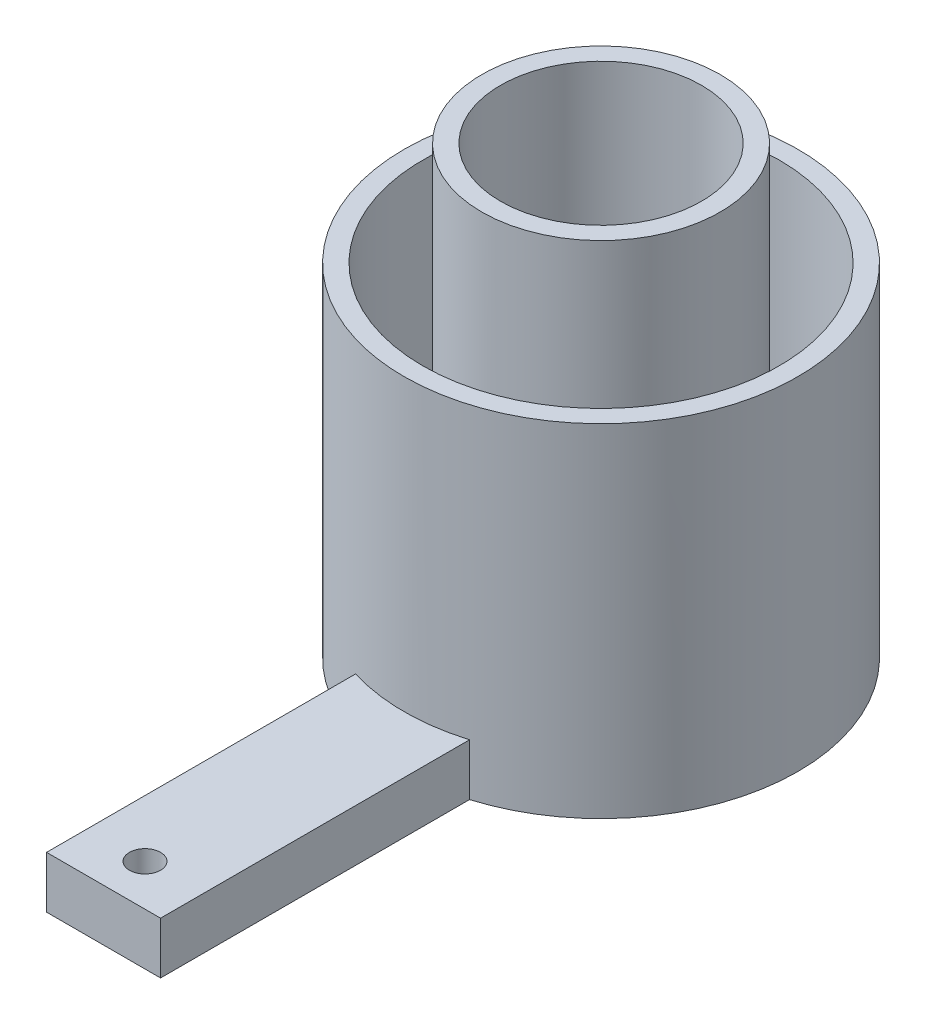
ISO-10303-21;
HEADER;
FILE_DESCRIPTION(('STEP AP214'),'2;1');
FILE_NAME('part.step','',(''),(''),'','','');
FILE_SCHEMA(('AUTOMOTIVE_DESIGN { 1 0 10303 214 1 1 1 1 }'));
ENDSEC;
DATA;
#1=APPLICATION_CONTEXT('core data for automotive mechanical design processes');
#2=APPLICATION_PROTOCOL_DEFINITION('international standard','automotive_design',2000,#1);
#3=PRODUCT_CONTEXT('',#1,'mechanical');
#4=PRODUCT('Part','Part','',(#3));
#5=PRODUCT_RELATED_PRODUCT_CATEGORY('part','',(#4));
#6=PRODUCT_DEFINITION_FORMATION('','',#4);
#7=PRODUCT_DEFINITION_CONTEXT('part definition',#1,'design');
#8=PRODUCT_DEFINITION('design','',#6,#7);
#9=PRODUCT_DEFINITION_SHAPE('','',#8);
#10=(LENGTH_UNIT() NAMED_UNIT(*) SI_UNIT(.MILLI.,.METRE.));
#11=(NAMED_UNIT(*) PLANE_ANGLE_UNIT() SI_UNIT($,.RADIAN.));
#12=(NAMED_UNIT(*) SI_UNIT($,.STERADIAN.) SOLID_ANGLE_UNIT());
#13=UNCERTAINTY_MEASURE_WITH_UNIT(LENGTH_MEASURE(1.E-05),#10,'distance_accuracy_value','');
#14=(GEOMETRIC_REPRESENTATION_CONTEXT(3) GLOBAL_UNCERTAINTY_ASSIGNED_CONTEXT((#13)) GLOBAL_UNIT_ASSIGNED_CONTEXT((#10,
#11,#12)) REPRESENTATION_CONTEXT('',''));
#15=CARTESIAN_POINT('',(0.,0.,0.));
#16=DIRECTION('',(0.,0.,1.));
#17=DIRECTION('',(1.,0.,0.));
#18=AXIS2_PLACEMENT_3D('',#15,#16,#17);
#19=CARTESIAN_POINT('',(0.,33.,0.));
#20=DIRECTION('',(0.,-1.,0.));
#21=DIRECTION('',(0.,0.,-1.));
#22=AXIS2_PLACEMENT_3D('',#19,#20,#21);
#23=CYLINDRICAL_SURFACE('',#22,17.2);
#24=CARTESIAN_POINT('',(0.,10.,0.));
#25=DIRECTION('',(0.,-1.,0.));
#26=DIRECTION('',(0.,0.,-1.));
#27=AXIS2_PLACEMENT_3D('',#24,#25,#26);
#28=CIRCLE('',#27,17.2);
#29=CARTESIAN_POINT('',(0.,10.,-17.2));
#30=VERTEX_POINT('',#29);
#31=EDGE_CURVE('E265',#30,#30,#28,.T.);
#32=ORIENTED_EDGE('',*,*,#31,.F.);
#33=EDGE_LOOP('',(#32));
#34=FACE_BOUND('',#33,.T.);
#35=CARTESIAN_POINT('',(0.,5.,0.));
#36=DIRECTION('',(0.,-1.,0.));
#37=DIRECTION('',(0.,0.,-1.));
#38=AXIS2_PLACEMENT_3D('',#35,#36,#37);
#39=CIRCLE('',#38,17.2);
#40=CARTESIAN_POINT('',(5.5,5.,16.2969322266493));
#41=VERTEX_POINT('',#40);
#42=CARTESIAN_POINT('',(-5.5,5.,16.2969322266493));
#43=VERTEX_POINT('',#42);
#44=EDGE_CURVE('E178',#41,#43,#39,.T.);
#45=ORIENTED_EDGE('',*,*,#44,.T.);
#46=DIRECTION('',(0.,-1.,0.));
#47=VECTOR('',#46,1.);
#48=CARTESIAN_POINT('',(-5.5,33.,16.2969322266493));
#49=LINE('',#48,#47);
#50=CARTESIAN_POINT('',(-5.5,0.,16.2969322266493));
#51=VERTEX_POINT('',#50);
#52=EDGE_CURVE('E186',#43,#51,#49,.T.);
#53=ORIENTED_EDGE('',*,*,#52,.T.);
#54=CARTESIAN_POINT('',(0.,0.,0.));
#55=DIRECTION('',(0.,1.,0.));
#56=DIRECTION('',(0.,0.,1.));
#57=AXIS2_PLACEMENT_3D('',#54,#55,#56);
#58=CIRCLE('',#57,17.2);
#59=CARTESIAN_POINT('',(-13.4339705934385,0.,-10.7409698861243));
#60=VERTEX_POINT('',#59);
#61=EDGE_CURVE('E266',#60,#51,#58,.T.);
#62=ORIENTED_EDGE('',*,*,#61,.F.);
#63=DIRECTION('',(0.,-1.,0.));
#64=VECTOR('',#63,1.);
#65=CARTESIAN_POINT('',(-13.4339705934385,33.,-10.7409698861243));
#66=LINE('',#65,#64);
#67=CARTESIAN_POINT('',(-13.4339705934385,2.4,-10.7409698861243));
#68=VERTEX_POINT('',#67);
#69=EDGE_CURVE('E225',#68,#60,#66,.T.);
#70=ORIENTED_EDGE('',*,*,#69,.F.);
#71=CARTESIAN_POINT('',(0.,2.4,0.));
#72=DIRECTION('',(0.,-1.,0.));
#73=DIRECTION('',(0.,0.,-1.));
#74=AXIS2_PLACEMENT_3D('',#71,#72,#73);
#75=CIRCLE('',#74,17.2);
#76=CARTESIAN_POINT('',(-6.92620660055423,2.4,-15.7438134556542));
#77=VERTEX_POINT('',#76);
#78=EDGE_CURVE('E231',#68,#77,#75,.T.);
#79=ORIENTED_EDGE('',*,*,#78,.T.);
#80=DIRECTION('',(0.,-1.,0.));
#81=VECTOR('',#80,1.);
#82=CARTESIAN_POINT('',(-6.92620660055423,33.,-15.7438134556542));
#83=LINE('',#82,#81);
#84=CARTESIAN_POINT('',(-6.92620660055423,0.,-15.7438134556542));
#85=VERTEX_POINT('',#84);
#86=EDGE_CURVE('E217',#85,#77,#83,.F.);
#87=ORIENTED_EDGE('',*,*,#86,.F.);
#88=CARTESIAN_POINT('',(5.5,0.,16.2969322266493));
#89=VERTEX_POINT('',#88);
#90=EDGE_CURVE('E257',#89,#85,#58,.T.);
#91=ORIENTED_EDGE('',*,*,#90,.F.);
#92=DIRECTION('',(0.,-1.,0.));
#93=VECTOR('',#92,1.);
#94=CARTESIAN_POINT('',(5.5,33.,16.2969322266493));
#95=LINE('',#94,#93);
#96=EDGE_CURVE('E182',#41,#89,#95,.T.);
#97=ORIENTED_EDGE('',*,*,#96,.F.);
#98=EDGE_LOOP('',(#45,#53,#62,#70,#79,#87,#91,#97));
#99=FACE_BOUND('',#98,.T.);
#100=ADVANCED_FACE('F36',(#34,#99),#23,.F.);
#101=CARTESIAN_POINT('',(0.,33.,0.));
#102=DIRECTION('',(0.,-1.,0.));
#103=DIRECTION('',(0.,0.,-1.));
#104=AXIS2_PLACEMENT_3D('',#101,#102,#103);
#105=CYLINDRICAL_SURFACE('',#104,19.);
#106=CARTESIAN_POINT('',(0.,33.,0.));
#107=DIRECTION('',(0.,1.,0.));
#108=DIRECTION('',(0.,0.,1.));
#109=AXIS2_PLACEMENT_3D('',#106,#107,#108);
#110=CIRCLE('',#109,19.);
#111=CARTESIAN_POINT('',(0.,33.,19.));
#112=VERTEX_POINT('',#111);
#113=EDGE_CURVE('E261',#112,#112,#110,.T.);
#114=ORIENTED_EDGE('',*,*,#113,.F.);
#115=EDGE_LOOP('',(#114));
#116=FACE_BOUND('',#115,.T.);
#117=DIRECTION('',(0.,-1.,0.));
#118=VECTOR('',#117,1.);
#119=CARTESIAN_POINT('',(-5.5,33.,18.1865334794732));
#120=LINE('',#119,#118);
#121=CARTESIAN_POINT('',(-5.5,5.,18.1865334794732));
#122=VERTEX_POINT('',#121);
#123=CARTESIAN_POINT('',(-5.5,0.,18.1865334794732));
#124=VERTEX_POINT('',#123);
#125=EDGE_CURVE('E51',#122,#124,#120,.T.);
#126=ORIENTED_EDGE('',*,*,#125,.F.);
#127=CARTESIAN_POINT('',(0.,5.,0.));
#128=DIRECTION('',(0.,-1.,0.));
#129=DIRECTION('',(0.,0.,-1.));
#130=AXIS2_PLACEMENT_3D('',#127,#128,#129);
#131=CIRCLE('',#130,19.);
#132=CARTESIAN_POINT('',(5.5,5.,18.1865334794732));
#133=VERTEX_POINT('',#132);
#134=EDGE_CURVE('E55',#133,#122,#131,.T.);
#135=ORIENTED_EDGE('',*,*,#134,.F.);
#136=DIRECTION('',(0.,-1.,0.));
#137=VECTOR('',#136,1.);
#138=CARTESIAN_POINT('',(5.5,33.,18.1865334794732));
#139=LINE('',#138,#137);
#140=CARTESIAN_POINT('',(5.5,0.,18.1865334794732));
#141=VERTEX_POINT('',#140);
#142=EDGE_CURVE('E155',#133,#141,#139,.T.);
#143=ORIENTED_EDGE('',*,*,#142,.T.);
#144=CARTESIAN_POINT('',(0.,0.,0.));
#145=DIRECTION('',(0.,1.,0.));
#146=DIRECTION('',(0.,0.,1.));
#147=AXIS2_PLACEMENT_3D('',#144,#145,#146);
#148=CIRCLE('',#147,19.);
#149=EDGE_CURVE('E262',#141,#124,#148,.T.);
#150=ORIENTED_EDGE('',*,*,#149,.T.);
#151=EDGE_LOOP('',(#126,#135,#143,#150));
#152=FACE_BOUND('',#151,.T.);
#153=ADVANCED_FACE('F319',(#116,#152),#105,.T.);
#154=CARTESIAN_POINT('',(0.,43.,0.));
#155=DIRECTION('',(0.,-1.,0.));
#156=DIRECTION('',(0.,0.,-1.));
#157=AXIS2_PLACEMENT_3D('',#154,#155,#156);
#158=CYLINDRICAL_SURFACE('',#157,11.5);
#159=CARTESIAN_POINT('',(0.,10.,0.));
#160=DIRECTION('',(0.,-1.,0.));
#161=DIRECTION('',(0.,0.,-1.));
#162=AXIS2_PLACEMENT_3D('',#159,#160,#161);
#163=CIRCLE('',#162,11.5);
#164=CARTESIAN_POINT('',(0.,10.,-11.5));
#165=VERTEX_POINT('',#164);
#166=EDGE_CURVE('E242',#165,#165,#163,.F.);
#167=ORIENTED_EDGE('',*,*,#166,.F.);
#168=EDGE_LOOP('',(#167));
#169=FACE_BOUND('',#168,.T.);
#170=DIRECTION('',(0.,-1.,0.));
#171=VECTOR('',#170,1.);
#172=CARTESIAN_POINT('',(-5.5,43.,10.0995049383621));
#173=LINE('',#172,#171);
#174=CARTESIAN_POINT('',(-5.5,5.,10.0995049383621));
#175=VERTEX_POINT('',#174);
#176=CARTESIAN_POINT('',(-5.5,0.,10.0995049383621));
#177=VERTEX_POINT('',#176);
#178=EDGE_CURVE('E11',#175,#177,#173,.T.);
#179=ORIENTED_EDGE('',*,*,#178,.F.);
#180=CARTESIAN_POINT('',(0.,5.,0.));
#181=DIRECTION('',(0.,-1.,0.));
#182=DIRECTION('',(0.,0.,-1.));
#183=AXIS2_PLACEMENT_3D('',#180,#181,#182);
#184=CIRCLE('',#183,11.5);
#185=CARTESIAN_POINT('',(5.5,5.,10.0995049383621));
#186=VERTEX_POINT('',#185);
#187=EDGE_CURVE('E278',#186,#175,#184,.T.);
#188=ORIENTED_EDGE('',*,*,#187,.F.);
#189=DIRECTION('',(0.,-1.,0.));
#190=VECTOR('',#189,1.);
#191=CARTESIAN_POINT('',(5.5,43.,10.0995049383621));
#192=LINE('',#191,#190);
#193=CARTESIAN_POINT('',(5.5,0.,10.0995049383621));
#194=VERTEX_POINT('',#193);
#195=EDGE_CURVE('E44',#186,#194,#192,.T.);
#196=ORIENTED_EDGE('',*,*,#195,.T.);
#197=CARTESIAN_POINT('',(0.,0.,0.));
#198=DIRECTION('',(0.,1.,0.));
#199=DIRECTION('',(0.,0.,1.));
#200=AXIS2_PLACEMENT_3D('',#197,#198,#199);
#201=CIRCLE('',#200,11.5);
#202=CARTESIAN_POINT('',(-5.01101741859494,0.,-10.3508310985417));
#203=VERTEX_POINT('',#202);
#204=EDGE_CURVE('E244',#194,#203,#201,.T.);
#205=ORIENTED_EDGE('',*,*,#204,.T.);
#206=DIRECTION('',(0.,-1.,0.));
#207=VECTOR('',#206,1.);
#208=CARTESIAN_POINT('',(-5.01101741859494,43.,-10.3508310985417));
#209=LINE('',#208,#207);
#210=CARTESIAN_POINT('',(-5.01101741859494,2.4,-10.3508310985417));
#211=VERTEX_POINT('',#210);
#212=EDGE_CURVE('E211',#203,#211,#209,.F.);
#213=ORIENTED_EDGE('',*,*,#212,.T.);
#214=CARTESIAN_POINT('',(0.,2.4,0.));
#215=DIRECTION('',(0.,-1.,0.));
#216=DIRECTION('',(0.,0.,-1.));
#217=AXIS2_PLACEMENT_3D('',#214,#215,#216);
#218=CIRCLE('',#217,11.5);
#219=CARTESIAN_POINT('',(-8.71463450240619,2.4,-7.50367546536173));
#220=VERTEX_POINT('',#219);
#221=EDGE_CURVE('E252',#220,#211,#218,.T.);
#222=ORIENTED_EDGE('',*,*,#221,.F.);
#223=DIRECTION('',(0.,-1.,0.));
#224=VECTOR('',#223,1.);
#225=CARTESIAN_POINT('',(-8.71463450240619,43.,-7.50367546536173));
#226=LINE('',#225,#224);
#227=CARTESIAN_POINT('',(-8.71463450240619,0.,-7.50367546536173));
#228=VERTEX_POINT('',#227);
#229=EDGE_CURVE('E219',#220,#228,#226,.T.);
#230=ORIENTED_EDGE('',*,*,#229,.T.);
#231=EDGE_CURVE('E239',#228,#177,#201,.T.);
#232=ORIENTED_EDGE('',*,*,#231,.T.);
#233=EDGE_LOOP('',(#179,#188,#196,#205,#213,#222,#230,#232));
#234=FACE_BOUND('',#233,.T.);
#235=ADVANCED_FACE('F285',(#169,#234),#158,.T.);
#236=CARTESIAN_POINT('',(0.,33.,0.));
#237=DIRECTION('',(0.,1.,0.));
#238=DIRECTION('',(0.,0.,1.));
#239=AXIS2_PLACEMENT_3D('',#236,#237,#238);
#240=CIRCLE('',#239,17.2);
#241=CARTESIAN_POINT('',(0.,33.,17.2));
#242=VERTEX_POINT('',#241);
#243=EDGE_CURVE('E258',#242,#242,#240,.T.);
#244=ORIENTED_EDGE('',*,*,#243,.T.);
#245=EDGE_LOOP('',(#244));
#246=FACE_BOUND('',#245,.T.);
#247=CARTESIAN_POINT('',(0.,13.,0.));
#248=DIRECTION('',(0.,-1.,0.));
#249=DIRECTION('',(0.,0.,-1.));
#250=AXIS2_PLACEMENT_3D('',#247,#248,#249);
#251=CIRCLE('',#250,17.2);
#252=CARTESIAN_POINT('',(0.,13.,-17.2));
#253=VERTEX_POINT('',#252);
#254=EDGE_CURVE('E254',#253,#253,#251,.T.);
#255=ORIENTED_EDGE('',*,*,#254,.T.);
#256=EDGE_LOOP('',(#255));
#257=FACE_BOUND('',#256,.T.);
#258=ADVANCED_FACE('F321',(#246,#257),#23,.F.);
#259=CARTESIAN_POINT('',(0.,33.,0.));
#260=DIRECTION('',(0.,1.,0.));
#261=DIRECTION('',(0.,0.,1.));
#262=AXIS2_PLACEMENT_3D('',#259,#260,#261);
#263=PLANE('',#262);
#264=ORIENTED_EDGE('',*,*,#243,.F.);
#265=EDGE_LOOP('',(#264));
#266=FACE_BOUND('',#265,.T.);
#267=ORIENTED_EDGE('',*,*,#113,.T.);
#268=EDGE_LOOP('',(#267));
#269=FACE_BOUND('',#268,.T.);
#270=ADVANCED_FACE('F329',(#266,#269),#263,.T.);
#271=CARTESIAN_POINT('',(0.,0.,0.));
#272=DIRECTION('',(0.,1.,0.));
#273=DIRECTION('',(0.,0.,1.));
#274=AXIS2_PLACEMENT_3D('',#271,#272,#273);
#275=PLANE('',#274);
#276=CARTESIAN_POINT('',(0.,0.,44.));
#277=DIRECTION('',(0.,-1.,0.));
#278=DIRECTION('',(0.,0.,-1.));
#279=AXIS2_PLACEMENT_3D('',#276,#277,#278);
#280=CIRCLE('',#279,1.5);
#281=CARTESIAN_POINT('',(0.,0.,42.5));
#282=VERTEX_POINT('',#281);
#283=EDGE_CURVE('E302',#282,#282,#280,.T.);
#284=ORIENTED_EDGE('',*,*,#283,.F.);
#285=EDGE_LOOP('',(#284));
#286=FACE_BOUND('',#285,.T.);
#287=ORIENTED_EDGE('',*,*,#61,.T.);
#288=DIRECTION('',(0.,0.,1.));
#289=VECTOR('',#288,1.);
#290=CARTESIAN_POINT('',(-5.5,0.,0.));
#291=LINE('',#290,#289);
#292=EDGE_CURVE('E297',#177,#51,#291,.T.);
#293=ORIENTED_EDGE('',*,*,#292,.F.);
#294=ORIENTED_EDGE('',*,*,#231,.F.);
#295=DIRECTION('',(-0.824632815792926,0.,-0.565668382639006));
#296=VECTOR('',#295,1.);
#297=CARTESIAN_POINT('',(-14.9219179053918,0.,-11.7616480998518));
#298=LINE('',#297,#296);
#299=EDGE_CURVE('E207',#228,#60,#298,.T.);
#300=ORIENTED_EDGE('',*,*,#299,.T.);
#301=EDGE_LOOP('',(#287,#293,#294,#300));
#302=FACE_BOUND('',#301,.T.);
#303=DIRECTION('',(0.,0.,1.));
#304=VECTOR('',#303,1.);
#305=CARTESIAN_POINT('',(5.5,0.,0.));
#306=LINE('',#305,#304);
#307=EDGE_CURVE('E290',#194,#89,#306,.T.);
#308=ORIENTED_EDGE('',*,*,#307,.T.);
#309=ORIENTED_EDGE('',*,*,#90,.T.);
#310=DIRECTION('',(0.334650429092405,0.,0.942342342415042));
#311=VECTOR('',#310,1.);
#312=CARTESIAN_POINT('',(-3.56545480144874,0.,-6.28027046473769));
#313=LINE('',#312,#311);
#314=EDGE_CURVE('E203',#85,#203,#313,.T.);
#315=ORIENTED_EDGE('',*,*,#314,.T.);
#316=ORIENTED_EDGE('',*,*,#204,.F.);
#317=EDGE_LOOP('',(#308,#309,#315,#316));
#318=FACE_BOUND('',#317,.T.);
#319=CARTESIAN_POINT('',(0.,0.,0.));
#320=DIRECTION('',(0.,1.,0.));
#321=DIRECTION('',(0.,0.,1.));
#322=AXIS2_PLACEMENT_3D('',#319,#320,#321);
#323=CIRCLE('',#322,9.7);
#324=CARTESIAN_POINT('',(-7.21964860347408,0.,-6.47816903471611));
#325=VERTEX_POINT('',#324);
#326=CARTESIAN_POINT('',(-4.40432597607253,0.,-8.64244830453112));
#327=VERTEX_POINT('',#326);
#328=EDGE_CURVE('E234',#325,#327,#323,.T.);
#329=ORIENTED_EDGE('',*,*,#328,.T.);
#330=CARTESIAN_POINT('',(-3.56545480144874,0.,-6.28027046473769));
#331=VERTEX_POINT('',#330);
#332=EDGE_CURVE('E189',#327,#331,#313,.T.);
#333=ORIENTED_EDGE('',*,*,#332,.T.);
#334=DIRECTION('',(-0.792808155570245,0.,0.609471269594642));
#335=VECTOR('',#334,1.);
#336=CARTESIAN_POINT('',(-5.1525342695895,0.,-5.06020312360444));
#337=LINE('',#336,#335);
#338=CARTESIAN_POINT('',(-5.1525342695895,0.,-5.06020312360444));
#339=VERTEX_POINT('',#338);
#340=EDGE_CURVE('E204',#331,#339,#337,.T.);
#341=ORIENTED_EDGE('',*,*,#340,.T.);
#342=EDGE_CURVE('E193',#339,#325,#298,.T.);
#343=ORIENTED_EDGE('',*,*,#342,.T.);
#344=EDGE_LOOP('',(#329,#333,#341,#343));
#345=FACE_BOUND('',#344,.T.);
#346=ORIENTED_EDGE('',*,*,#149,.F.);
#347=CARTESIAN_POINT('',(5.5,0.,48.));
#348=VERTEX_POINT('',#347);
#349=EDGE_CURVE('E295',#141,#348,#306,.T.);
#350=ORIENTED_EDGE('',*,*,#349,.T.);
#351=DIRECTION('',(1.,0.,0.));
#352=VECTOR('',#351,1.);
#353=CARTESIAN_POINT('',(0.,0.,48.));
#354=LINE('',#353,#352);
#355=CARTESIAN_POINT('',(-5.5,0.,48.));
#356=VERTEX_POINT('',#355);
#357=EDGE_CURVE('E171',#356,#348,#354,.T.);
#358=ORIENTED_EDGE('',*,*,#357,.F.);
#359=EDGE_CURVE('E299',#124,#356,#291,.T.);
#360=ORIENTED_EDGE('',*,*,#359,.F.);
#361=EDGE_LOOP('',(#346,#350,#358,#360));
#362=FACE_BOUND('',#361,.T.);
#363=ADVANCED_FACE('F335',(#286,#302,#318,#345,#362),#275,.F.);
#364=CARTESIAN_POINT('',(0.,10.,0.));
#365=DIRECTION('',(0.,-1.,0.));
#366=DIRECTION('',(0.,0.,-1.));
#367=AXIS2_PLACEMENT_3D('',#364,#365,#366);
#368=PLANE('',#367);
#369=ORIENTED_EDGE('',*,*,#166,.T.);
#370=EDGE_LOOP('',(#369));
#371=FACE_BOUND('',#370,.T.);
#372=ORIENTED_EDGE('',*,*,#31,.T.);
#373=EDGE_LOOP('',(#372));
#374=FACE_BOUND('',#373,.T.);
#375=ADVANCED_FACE('F348',(#371,#374),#368,.T.);
#376=CARTESIAN_POINT('',(0.,13.,0.));
#377=DIRECTION('',(0.,-1.,0.));
#378=DIRECTION('',(0.,0.,-1.));
#379=AXIS2_PLACEMENT_3D('',#376,#377,#378);
#380=PLANE('',#379);
#381=CARTESIAN_POINT('',(0.,13.,0.));
#382=DIRECTION('',(0.,-1.,0.));
#383=DIRECTION('',(0.,0.,-1.));
#384=AXIS2_PLACEMENT_3D('',#381,#382,#383);
#385=CIRCLE('',#384,11.5);
#386=CARTESIAN_POINT('',(0.,13.,-11.5));
#387=VERTEX_POINT('',#386);
#388=EDGE_CURVE('E253',#387,#387,#385,.F.);
#389=ORIENTED_EDGE('',*,*,#388,.F.);
#390=EDGE_LOOP('',(#389));
#391=FACE_BOUND('',#390,.T.);
#392=ORIENTED_EDGE('',*,*,#254,.F.);
#393=EDGE_LOOP('',(#392));
#394=FACE_BOUND('',#393,.T.);
#395=ADVANCED_FACE('F345',(#391,#394),#380,.F.);
#396=CARTESIAN_POINT('',(0.,43.,0.));
#397=DIRECTION('',(0.,-1.,0.));
#398=DIRECTION('',(0.,0.,-1.));
#399=AXIS2_PLACEMENT_3D('',#396,#397,#398);
#400=CYLINDRICAL_SURFACE('',#399,9.7);
#401=CARTESIAN_POINT('',(0.,43.,0.));
#402=DIRECTION('',(0.,1.,0.));
#403=DIRECTION('',(0.,0.,1.));
#404=AXIS2_PLACEMENT_3D('',#401,#402,#403);
#405=CIRCLE('',#404,9.7);
#406=CARTESIAN_POINT('',(0.,43.,9.7));
#407=VERTEX_POINT('',#406);
#408=EDGE_CURVE('E235',#407,#407,#405,.T.);
#409=ORIENTED_EDGE('',*,*,#408,.T.);
#410=EDGE_LOOP('',(#409));
#411=FACE_BOUND('',#410,.T.);
#412=CARTESIAN_POINT('',(0.,13.,0.));
#413=DIRECTION('',(0.,-1.,0.));
#414=DIRECTION('',(0.,0.,-1.));
#415=AXIS2_PLACEMENT_3D('',#412,#413,#414);
#416=CIRCLE('',#415,9.7);
#417=CARTESIAN_POINT('',(0.,13.,-9.7));
#418=VERTEX_POINT('',#417);
#419=EDGE_CURVE('E248',#418,#418,#416,.F.);
#420=ORIENTED_EDGE('',*,*,#419,.F.);
#421=EDGE_LOOP('',(#420));
#422=FACE_BOUND('',#421,.T.);
#423=ADVANCED_FACE('F347',(#411,#422),#400,.F.);
#424=CARTESIAN_POINT('',(0.,43.,0.));
#425=DIRECTION('',(0.,1.,0.));
#426=DIRECTION('',(0.,0.,1.));
#427=AXIS2_PLACEMENT_3D('',#424,#425,#426);
#428=PLANE('',#427);
#429=ORIENTED_EDGE('',*,*,#408,.F.);
#430=EDGE_LOOP('',(#429));
#431=FACE_BOUND('',#430,.T.);
#432=CARTESIAN_POINT('',(0.,43.,0.));
#433=DIRECTION('',(0.,1.,0.));
#434=DIRECTION('',(0.,0.,1.));
#435=AXIS2_PLACEMENT_3D('',#432,#433,#434);
#436=CIRCLE('',#435,11.5);
#437=CARTESIAN_POINT('',(0.,43.,11.5));
#438=VERTEX_POINT('',#437);
#439=EDGE_CURVE('E238',#438,#438,#436,.T.);
#440=ORIENTED_EDGE('',*,*,#439,.T.);
#441=EDGE_LOOP('',(#440));
#442=FACE_BOUND('',#441,.T.);
#443=ADVANCED_FACE('F356',(#431,#442),#428,.T.);
#444=ORIENTED_EDGE('',*,*,#439,.F.);
#445=EDGE_LOOP('',(#444));
#446=FACE_BOUND('',#445,.T.);
#447=ORIENTED_EDGE('',*,*,#388,.T.);
#448=EDGE_LOOP('',(#447));
#449=FACE_BOUND('',#448,.T.);
#450=ADVANCED_FACE('F340',(#446,#449),#158,.T.);
#451=ORIENTED_EDGE('',*,*,#419,.T.);
#452=EDGE_LOOP('',(#451));
#453=FACE_BOUND('',#452,.T.);
#454=ADVANCED_FACE('F351',(#453),#380,.F.);
#455=DIRECTION('',(0.,-1.,0.));
#456=VECTOR('',#455,1.);
#457=CARTESIAN_POINT('',(-4.40432597607253,43.,-8.64244830453112));
#458=LINE('',#457,#456);
#459=CARTESIAN_POINT('',(-4.40432597607253,2.4,-8.64244830453112));
#460=VERTEX_POINT('',#459);
#461=EDGE_CURVE('E215',#327,#460,#458,.F.);
#462=ORIENTED_EDGE('',*,*,#461,.F.);
#463=ORIENTED_EDGE('',*,*,#328,.F.);
#464=DIRECTION('',(0.,-1.,0.));
#465=VECTOR('',#464,1.);
#466=CARTESIAN_POINT('',(-7.21964860347408,43.,-6.47816903471611));
#467=LINE('',#466,#465);
#468=CARTESIAN_POINT('',(-7.21964860347408,2.4,-6.47816903471611));
#469=VERTEX_POINT('',#468);
#470=EDGE_CURVE('E222',#469,#325,#467,.T.);
#471=ORIENTED_EDGE('',*,*,#470,.F.);
#472=CARTESIAN_POINT('',(0.,2.4,0.));
#473=DIRECTION('',(0.,-1.,0.));
#474=DIRECTION('',(0.,0.,-1.));
#475=AXIS2_PLACEMENT_3D('',#472,#473,#474);
#476=CIRCLE('',#475,9.7);
#477=EDGE_CURVE('E228',#469,#460,#476,.T.);
#478=ORIENTED_EDGE('',*,*,#477,.T.);
#479=EDGE_LOOP('',(#462,#463,#471,#478));
#480=FACE_BOUND('',#479,.T.);
#481=CARTESIAN_POINT('',(0.,10.,0.));
#482=DIRECTION('',(0.,-1.,0.));
#483=DIRECTION('',(0.,0.,-1.));
#484=AXIS2_PLACEMENT_3D('',#481,#482,#483);
#485=CIRCLE('',#484,9.7);
#486=CARTESIAN_POINT('',(0.,10.,-9.7));
#487=VERTEX_POINT('',#486);
#488=EDGE_CURVE('E249',#487,#487,#485,.F.);
#489=ORIENTED_EDGE('',*,*,#488,.T.);
#490=EDGE_LOOP('',(#489));
#491=FACE_BOUND('',#490,.T.);
#492=ADVANCED_FACE('F359',(#480,#491),#400,.F.);
#493=ORIENTED_EDGE('',*,*,#488,.F.);
#494=EDGE_LOOP('',(#493));
#495=FACE_BOUND('',#494,.T.);
#496=ADVANCED_FACE('F362',(#495),#368,.T.);
#497=CARTESIAN_POINT('',(0.,2.4,0.));
#498=DIRECTION('',(0.,-1.,0.));
#499=DIRECTION('',(0.,0.,-1.));
#500=AXIS2_PLACEMENT_3D('',#497,#498,#499);
#501=PLANE('',#500);
#502=ORIENTED_EDGE('',*,*,#78,.F.);
#503=DIRECTION('',(-0.824632815792926,0.,-0.565668382639006));
#504=VECTOR('',#503,1.);
#505=CARTESIAN_POINT('',(-14.9219179053918,2.4,-11.7616480998518));
#506=LINE('',#505,#504);
#507=EDGE_CURVE('E197',#220,#68,#506,.T.);
#508=ORIENTED_EDGE('',*,*,#507,.F.);
#509=ORIENTED_EDGE('',*,*,#221,.T.);
#510=DIRECTION('',(0.334650429092405,0.,0.942342342415042));
#511=VECTOR('',#510,1.);
#512=CARTESIAN_POINT('',(-3.56545480144874,2.4,-6.28027046473769));
#513=LINE('',#512,#511);
#514=EDGE_CURVE('E192',#77,#211,#513,.T.);
#515=ORIENTED_EDGE('',*,*,#514,.F.);
#516=EDGE_LOOP('',(#502,#508,#509,#515));
#517=FACE_BOUND('',#516,.T.);
#518=ADVANCED_FACE('F397',(#517),#501,.F.);
#519=CARTESIAN_POINT('',(-3.56545480144874,2.4,-6.28027046473769));
#520=DIRECTION('',(0.942342342415042,0.,-0.334650429092405));
#521=DIRECTION('',(-0.334650429092405,0.,-0.942342342415043));
#522=AXIS2_PLACEMENT_3D('',#519,#520,#521);
#523=PLANE('',#522);
#524=ORIENTED_EDGE('',*,*,#314,.F.);
#525=ORIENTED_EDGE('',*,*,#86,.T.);
#526=ORIENTED_EDGE('',*,*,#514,.T.);
#527=ORIENTED_EDGE('',*,*,#212,.F.);
#528=EDGE_LOOP('',(#524,#525,#526,#527));
#529=FACE_BOUND('',#528,.T.);
#530=ADVANCED_FACE('F387',(#529),#523,.T.);
#531=CARTESIAN_POINT('',(-14.9219179053918,2.4,-11.7616480998518));
#532=DIRECTION('',(-0.565668382639006,0.,0.824632815792926));
#533=DIRECTION('',(0.824632815792926,0.,0.565668382639006));
#534=AXIS2_PLACEMENT_3D('',#531,#532,#533);
#535=PLANE('',#534);
#536=ORIENTED_EDGE('',*,*,#507,.T.);
#537=ORIENTED_EDGE('',*,*,#69,.T.);
#538=ORIENTED_EDGE('',*,*,#299,.F.);
#539=ORIENTED_EDGE('',*,*,#229,.F.);
#540=EDGE_LOOP('',(#536,#537,#538,#539));
#541=FACE_BOUND('',#540,.T.);
#542=ADVANCED_FACE('F396',(#541),#535,.T.);
#543=ORIENTED_EDGE('',*,*,#477,.F.);
#544=CARTESIAN_POINT('',(-5.1525342695895,2.4,-5.06020312360444));
#545=VERTEX_POINT('',#544);
#546=EDGE_CURVE('E198',#545,#469,#506,.T.);
#547=ORIENTED_EDGE('',*,*,#546,.F.);
#548=DIRECTION('',(-0.792808155570245,0.,0.609471269594642));
#549=VECTOR('',#548,1.);
#550=CARTESIAN_POINT('',(-5.1525342695895,2.4,-5.06020312360444));
#551=LINE('',#550,#549);
#552=CARTESIAN_POINT('',(-3.56545480144874,2.4,-6.28027046473769));
#553=VERTEX_POINT('',#552);
#554=EDGE_CURVE('E194',#553,#545,#551,.T.);
#555=ORIENTED_EDGE('',*,*,#554,.F.);
#556=EDGE_CURVE('E190',#460,#553,#513,.T.);
#557=ORIENTED_EDGE('',*,*,#556,.F.);
#558=EDGE_LOOP('',(#543,#547,#555,#557));
#559=FACE_BOUND('',#558,.T.);
#560=ADVANCED_FACE('F394',(#559),#501,.F.);
#561=ORIENTED_EDGE('',*,*,#546,.T.);
#562=ORIENTED_EDGE('',*,*,#470,.T.);
#563=ORIENTED_EDGE('',*,*,#342,.F.);
#564=DIRECTION('',(0.,-1.,0.));
#565=VECTOR('',#564,1.);
#566=CARTESIAN_POINT('',(-5.1525342695895,2.4,-5.06020312360444));
#567=LINE('',#566,#565);
#568=EDGE_CURVE('E209',#545,#339,#567,.T.);
#569=ORIENTED_EDGE('',*,*,#568,.F.);
#570=EDGE_LOOP('',(#561,#562,#563,#569));
#571=FACE_BOUND('',#570,.T.);
#572=ADVANCED_FACE('F390',(#571),#535,.T.);
#573=CARTESIAN_POINT('',(-5.1525342695895,2.4,-5.06020312360444));
#574=DIRECTION('',(0.609471269594643,0.,0.792808155570246));
#575=DIRECTION('',(0.792808155570246,0.,-0.609471269594643));
#576=AXIS2_PLACEMENT_3D('',#573,#574,#575);
#577=PLANE('',#576);
#578=ORIENTED_EDGE('',*,*,#340,.F.);
#579=DIRECTION('',(0.,-1.,0.));
#580=VECTOR('',#579,1.);
#581=CARTESIAN_POINT('',(-3.56545480144874,2.4,-6.28027046473769));
#582=LINE('',#581,#580);
#583=EDGE_CURVE('E201',#553,#331,#582,.T.);
#584=ORIENTED_EDGE('',*,*,#583,.F.);
#585=ORIENTED_EDGE('',*,*,#554,.T.);
#586=ORIENTED_EDGE('',*,*,#568,.T.);
#587=EDGE_LOOP('',(#578,#584,#585,#586));
#588=FACE_BOUND('',#587,.T.);
#589=ADVANCED_FACE('F385',(#588),#577,.T.);
#590=ORIENTED_EDGE('',*,*,#332,.F.);
#591=ORIENTED_EDGE('',*,*,#461,.T.);
#592=ORIENTED_EDGE('',*,*,#556,.T.);
#593=ORIENTED_EDGE('',*,*,#583,.T.);
#594=EDGE_LOOP('',(#590,#591,#592,#593));
#595=FACE_BOUND('',#594,.T.);
#596=ADVANCED_FACE('F382',(#595),#523,.T.);
#597=CARTESIAN_POINT('',(0.,5.,0.));
#598=DIRECTION('',(0.,-1.,0.));
#599=DIRECTION('',(0.,0.,-1.));
#600=AXIS2_PLACEMENT_3D('',#597,#598,#599);
#601=PLANE('',#600);
#602=ORIENTED_EDGE('',*,*,#44,.F.);
#603=DIRECTION('',(0.,0.,1.));
#604=VECTOR('',#603,1.);
#605=CARTESIAN_POINT('',(5.5,5.,0.));
#606=LINE('',#605,#604);
#607=EDGE_CURVE('E157',#186,#41,#606,.T.);
#608=ORIENTED_EDGE('',*,*,#607,.F.);
#609=ORIENTED_EDGE('',*,*,#187,.T.);
#610=DIRECTION('',(0.,0.,1.));
#611=VECTOR('',#610,1.);
#612=CARTESIAN_POINT('',(-5.5,5.,0.));
#613=LINE('',#612,#611);
#614=EDGE_CURVE('E158',#175,#43,#613,.T.);
#615=ORIENTED_EDGE('',*,*,#614,.T.);
#616=EDGE_LOOP('',(#602,#608,#609,#615));
#617=FACE_BOUND('',#616,.T.);
#618=ADVANCED_FACE('F317',(#617),#601,.F.);
#619=CARTESIAN_POINT('',(5.5,5.,0.));
#620=DIRECTION('',(1.,0.,0.));
#621=DIRECTION('',(0.,0.,-1.));
#622=AXIS2_PLACEMENT_3D('',#619,#620,#621);
#623=PLANE('',#622);
#624=ORIENTED_EDGE('',*,*,#607,.T.);
#625=ORIENTED_EDGE('',*,*,#96,.T.);
#626=ORIENTED_EDGE('',*,*,#307,.F.);
#627=ORIENTED_EDGE('',*,*,#195,.F.);
#628=EDGE_LOOP('',(#624,#625,#626,#627));
#629=FACE_BOUND('',#628,.T.);
#630=ADVANCED_FACE('F291',(#629),#623,.T.);
#631=CARTESIAN_POINT('',(-5.5,5.,0.));
#632=DIRECTION('',(1.,0.,0.));
#633=DIRECTION('',(0.,0.,-1.));
#634=AXIS2_PLACEMENT_3D('',#631,#632,#633);
#635=PLANE('',#634);
#636=ORIENTED_EDGE('',*,*,#52,.F.);
#637=ORIENTED_EDGE('',*,*,#614,.F.);
#638=ORIENTED_EDGE('',*,*,#178,.T.);
#639=ORIENTED_EDGE('',*,*,#292,.T.);
#640=EDGE_LOOP('',(#636,#637,#638,#639));
#641=FACE_BOUND('',#640,.T.);
#642=ADVANCED_FACE('F404',(#641),#635,.F.);
#643=CARTESIAN_POINT('',(-5.5,5.,48.));
#644=VERTEX_POINT('',#643);
#645=EDGE_CURVE('E164',#122,#644,#613,.T.);
#646=ORIENTED_EDGE('',*,*,#645,.F.);
#647=ORIENTED_EDGE('',*,*,#125,.T.);
#648=ORIENTED_EDGE('',*,*,#359,.T.);
#649=DIRECTION('',(0.,-1.,0.));
#650=VECTOR('',#649,1.);
#651=CARTESIAN_POINT('',(-5.5,5.,48.));
#652=LINE('',#651,#650);
#653=EDGE_CURVE('E172',#644,#356,#652,.T.);
#654=ORIENTED_EDGE('',*,*,#653,.F.);
#655=EDGE_LOOP('',(#646,#647,#648,#654));
#656=FACE_BOUND('',#655,.T.);
#657=ADVANCED_FACE('F401',(#656),#635,.F.);
#658=ORIENTED_EDGE('',*,*,#142,.F.);
#659=CARTESIAN_POINT('',(5.5,5.,48.));
#660=VERTEX_POINT('',#659);
#661=EDGE_CURVE('E148',#133,#660,#606,.T.);
#662=ORIENTED_EDGE('',*,*,#661,.T.);
#663=DIRECTION('',(0.,-1.,0.));
#664=VECTOR('',#663,1.);
#665=CARTESIAN_POINT('',(5.5,5.,48.));
#666=LINE('',#665,#664);
#667=EDGE_CURVE('E153',#660,#348,#666,.T.);
#668=ORIENTED_EDGE('',*,*,#667,.T.);
#669=ORIENTED_EDGE('',*,*,#349,.F.);
#670=EDGE_LOOP('',(#658,#662,#668,#669));
#671=FACE_BOUND('',#670,.T.);
#672=ADVANCED_FACE('F150',(#671),#623,.T.);
#673=CARTESIAN_POINT('',(0.,5.,48.));
#674=DIRECTION('',(0.,0.,-1.));
#675=DIRECTION('',(-1.,0.,0.));
#676=AXIS2_PLACEMENT_3D('',#673,#674,#675);
#677=PLANE('',#676);
#678=ORIENTED_EDGE('',*,*,#357,.T.);
#679=ORIENTED_EDGE('',*,*,#667,.F.);
#680=DIRECTION('',(1.,0.,0.));
#681=VECTOR('',#680,1.);
#682=CARTESIAN_POINT('',(0.,5.,48.));
#683=LINE('',#682,#681);
#684=EDGE_CURVE('E161',#644,#660,#683,.T.);
#685=ORIENTED_EDGE('',*,*,#684,.F.);
#686=ORIENTED_EDGE('',*,*,#653,.T.);
#687=EDGE_LOOP('',(#678,#679,#685,#686));
#688=FACE_BOUND('',#687,.T.);
#689=ADVANCED_FACE('F169',(#688),#677,.F.);
#690=CARTESIAN_POINT('',(0.,5.,44.));
#691=DIRECTION('',(0.,-1.,0.));
#692=DIRECTION('',(0.,0.,-1.));
#693=AXIS2_PLACEMENT_3D('',#690,#691,#692);
#694=CIRCLE('',#693,1.5);
#695=CARTESIAN_POINT('',(0.,5.,42.5));
#696=VERTEX_POINT('',#695);
#697=EDGE_CURVE('E39',#696,#696,#694,.T.);
#698=ORIENTED_EDGE('',*,*,#697,.T.);
#699=EDGE_LOOP('',(#698));
#700=FACE_BOUND('',#699,.T.);
#701=ORIENTED_EDGE('',*,*,#661,.F.);
#702=ORIENTED_EDGE('',*,*,#134,.T.);
#703=ORIENTED_EDGE('',*,*,#645,.T.);
#704=ORIENTED_EDGE('',*,*,#684,.T.);
#705=EDGE_LOOP('',(#701,#702,#703,#704));
#706=FACE_BOUND('',#705,.T.);
#707=ADVANCED_FACE('F162',(#700,#706),#601,.F.);
#708=CARTESIAN_POINT('',(0.,43.,44.));
#709=DIRECTION('',(0.,-1.,0.));
#710=DIRECTION('',(0.,0.,-1.));
#711=AXIS2_PLACEMENT_3D('',#708,#709,#710);
#712=CYLINDRICAL_SURFACE('',#711,1.5);
#713=ORIENTED_EDGE('',*,*,#283,.T.);
#714=EDGE_LOOP('',(#713));
#715=FACE_BOUND('',#714,.T.);
#716=ORIENTED_EDGE('',*,*,#697,.F.);
#717=EDGE_LOOP('',(#716));
#718=FACE_BOUND('',#717,.T.);
#719=ADVANCED_FACE('F310',(#715,#718),#712,.F.);
#720=CLOSED_SHELL('',(#100,#153,#235,#258,#270,#363,#375,#395,#423,#443,#450,#454,#492,#496,
#518,#530,#542,#560,#572,#589,#596,#618,#630,#642,#657,#672,#689,#707,#719));
#721=MANIFOLD_SOLID_BREP('B2',#720);
#722=ADVANCED_BREP_SHAPE_REPRESENTATION('',(#18,#721),#14);
#723=SHAPE_DEFINITION_REPRESENTATION(#9,#722);
ENDSEC;
END-ISO-10303-21;
